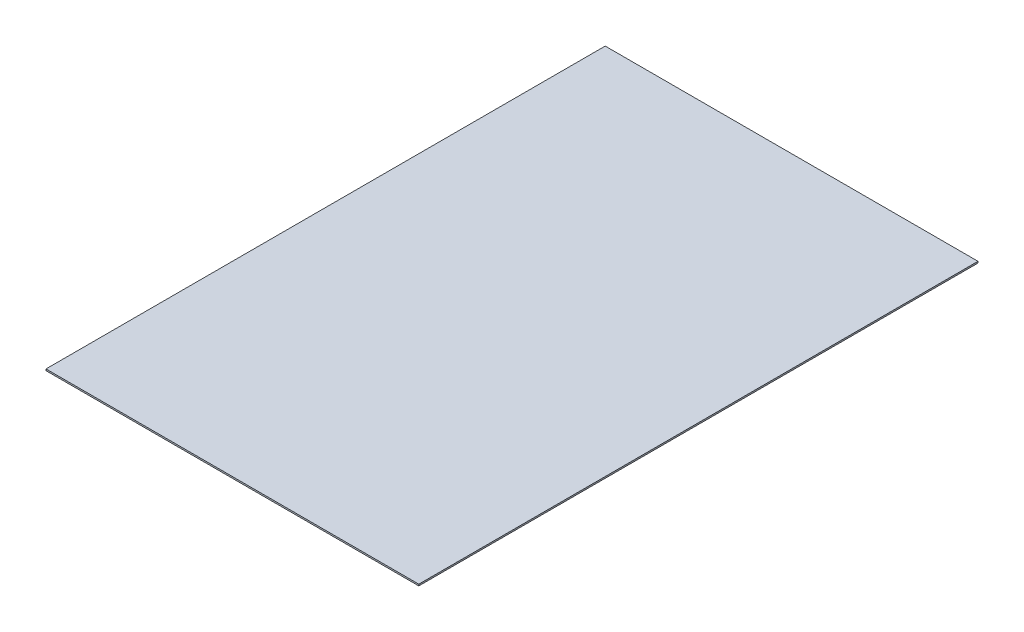
ISO-10303-21;
HEADER;
FILE_DESCRIPTION(('STEP AP214'),'2;1');
FILE_NAME('part.step','',(''),(''),'','','');
FILE_SCHEMA(('AUTOMOTIVE_DESIGN { 1 0 10303 214 1 1 1 1 }'));
ENDSEC;
DATA;
#1=APPLICATION_CONTEXT('core data for automotive mechanical design processes');
#2=APPLICATION_PROTOCOL_DEFINITION('international standard','automotive_design',2000,#1);
#3=PRODUCT_CONTEXT('',#1,'mechanical');
#4=PRODUCT('Part','Part','',(#3));
#5=PRODUCT_RELATED_PRODUCT_CATEGORY('part','',(#4));
#6=PRODUCT_DEFINITION_FORMATION('','',#4);
#7=PRODUCT_DEFINITION_CONTEXT('part definition',#1,'design');
#8=PRODUCT_DEFINITION('design','',#6,#7);
#9=PRODUCT_DEFINITION_SHAPE('','',#8);
#10=(LENGTH_UNIT() NAMED_UNIT(*) SI_UNIT(.MILLI.,.METRE.));
#11=(NAMED_UNIT(*) PLANE_ANGLE_UNIT() SI_UNIT($,.RADIAN.));
#12=(NAMED_UNIT(*) SI_UNIT($,.STERADIAN.) SOLID_ANGLE_UNIT());
#13=UNCERTAINTY_MEASURE_WITH_UNIT(LENGTH_MEASURE(1.E-05),#10,'distance_accuracy_value','');
#14=(GEOMETRIC_REPRESENTATION_CONTEXT(3) GLOBAL_UNCERTAINTY_ASSIGNED_CONTEXT((#13)) GLOBAL_UNIT_ASSIGNED_CONTEXT((#10,
#11,#12)) REPRESENTATION_CONTEXT('',''));
#15=CARTESIAN_POINT('',(0.,0.,0.));
#16=DIRECTION('',(0.,0.,1.));
#17=DIRECTION('',(1.,0.,0.));
#18=AXIS2_PLACEMENT_3D('',#15,#16,#17);
#19=CARTESIAN_POINT('',(-381.000000000001,3.175,571.499999999998));
#20=DIRECTION('',(0.,0.,-1.));
#21=DIRECTION('',(-1.,0.,0.));
#22=AXIS2_PLACEMENT_3D('',#19,#20,#21);
#23=PLANE('',#22);
#24=DIRECTION('',(1.,0.,0.));
#25=VECTOR('',#24,1.);
#26=CARTESIAN_POINT('',(-381.000000000001,0.,571.499999999998));
#27=LINE('',#26,#25);
#28=CARTESIAN_POINT('',(-381.000000000001,0.,571.499999999998));
#29=VERTEX_POINT('',#28);
#30=CARTESIAN_POINT('',(380.999999999999,0.,571.499999999998));
#31=VERTEX_POINT('',#30);
#32=EDGE_CURVE('E96',#29,#31,#27,.T.);
#33=ORIENTED_EDGE('',*,*,#32,.T.);
#34=DIRECTION('',(0.,-1.,0.));
#35=VECTOR('',#34,1.);
#36=CARTESIAN_POINT('',(380.999999999999,3.175,571.499999999998));
#37=LINE('',#36,#35);
#38=CARTESIAN_POINT('',(380.999999999999,3.175,571.499999999998));
#39=VERTEX_POINT('',#38);
#40=EDGE_CURVE('E11',#39,#31,#37,.T.);
#41=ORIENTED_EDGE('',*,*,#40,.F.);
#42=DIRECTION('',(1.,0.,0.));
#43=VECTOR('',#42,1.);
#44=CARTESIAN_POINT('',(-381.000000000001,3.175,571.499999999998));
#45=LINE('',#44,#43);
#46=CARTESIAN_POINT('',(-381.000000000001,3.175,571.499999999998));
#47=VERTEX_POINT('',#46);
#48=EDGE_CURVE('E82',#47,#39,#45,.T.);
#49=ORIENTED_EDGE('',*,*,#48,.F.);
#50=DIRECTION('',(0.,-1.,0.));
#51=VECTOR('',#50,1.);
#52=CARTESIAN_POINT('',(-381.000000000001,3.175,571.499999999998));
#53=LINE('',#52,#51);
#54=EDGE_CURVE('E49',#47,#29,#53,.T.);
#55=ORIENTED_EDGE('',*,*,#54,.T.);
#56=EDGE_LOOP('',(#33,#41,#49,#55));
#57=FACE_BOUND('',#56,.T.);
#58=ADVANCED_FACE('F33',(#57),#23,.F.);
#59=CARTESIAN_POINT('',(380.999999999999,3.175,571.499999999998));
#60=DIRECTION('',(-1.,0.,0.));
#61=DIRECTION('',(0.,0.,1.));
#62=AXIS2_PLACEMENT_3D('',#59,#60,#61);
#63=PLANE('',#62);
#64=DIRECTION('',(0.,0.,-1.));
#65=VECTOR('',#64,1.);
#66=CARTESIAN_POINT('',(380.999999999999,0.,571.499999999998));
#67=LINE('',#66,#65);
#68=CARTESIAN_POINT('',(380.999999999999,0.,-571.500000000001));
#69=VERTEX_POINT('',#68);
#70=EDGE_CURVE('E87',#31,#69,#67,.T.);
#71=ORIENTED_EDGE('',*,*,#70,.T.);
#72=DIRECTION('',(0.,-1.,0.));
#73=VECTOR('',#72,1.);
#74=CARTESIAN_POINT('',(380.999999999999,3.175,-571.500000000001));
#75=LINE('',#74,#73);
#76=CARTESIAN_POINT('',(380.999999999999,3.175,-571.500000000001));
#77=VERTEX_POINT('',#76);
#78=EDGE_CURVE('E41',#77,#69,#75,.T.);
#79=ORIENTED_EDGE('',*,*,#78,.F.);
#80=DIRECTION('',(0.,0.,-1.));
#81=VECTOR('',#80,1.);
#82=CARTESIAN_POINT('',(380.999999999999,3.175,571.499999999998));
#83=LINE('',#82,#81);
#84=EDGE_CURVE('E74',#39,#77,#83,.T.);
#85=ORIENTED_EDGE('',*,*,#84,.F.);
#86=ORIENTED_EDGE('',*,*,#40,.T.);
#87=EDGE_LOOP('',(#71,#79,#85,#86));
#88=FACE_BOUND('',#87,.T.);
#89=ADVANCED_FACE('F86',(#88),#63,.F.);
#90=CARTESIAN_POINT('',(-381.000000000001,3.175,-571.500000000001));
#91=DIRECTION('',(0.,0.,-1.));
#92=DIRECTION('',(-1.,0.,0.));
#93=AXIS2_PLACEMENT_3D('',#90,#91,#92);
#94=PLANE('',#93);
#95=DIRECTION('',(1.,0.,0.));
#96=VECTOR('',#95,1.);
#97=CARTESIAN_POINT('',(-381.000000000001,0.,-571.500000000001));
#98=LINE('',#97,#96);
#99=CARTESIAN_POINT('',(-381.000000000001,0.,-571.500000000001));
#100=VERTEX_POINT('',#99);
#101=EDGE_CURVE('E99',#100,#69,#98,.T.);
#102=ORIENTED_EDGE('',*,*,#101,.F.);
#103=DIRECTION('',(0.,-1.,0.));
#104=VECTOR('',#103,1.);
#105=CARTESIAN_POINT('',(-381.000000000001,3.175,-571.500000000001));
#106=LINE('',#105,#104);
#107=CARTESIAN_POINT('',(-381.000000000001,3.175,-571.500000000001));
#108=VERTEX_POINT('',#107);
#109=EDGE_CURVE('E63',#108,#100,#106,.T.);
#110=ORIENTED_EDGE('',*,*,#109,.F.);
#111=DIRECTION('',(1.,0.,0.));
#112=VECTOR('',#111,1.);
#113=CARTESIAN_POINT('',(-381.000000000001,3.175,-571.500000000001));
#114=LINE('',#113,#112);
#115=EDGE_CURVE('E81',#108,#77,#114,.T.);
#116=ORIENTED_EDGE('',*,*,#115,.T.);
#117=ORIENTED_EDGE('',*,*,#78,.T.);
#118=EDGE_LOOP('',(#102,#110,#116,#117));
#119=FACE_BOUND('',#118,.T.);
#120=ADVANCED_FACE('F90',(#119),#94,.T.);
#121=CARTESIAN_POINT('',(-381.000000000001,3.175,571.499999999998));
#122=DIRECTION('',(-1.,0.,0.));
#123=DIRECTION('',(0.,0.,1.));
#124=AXIS2_PLACEMENT_3D('',#121,#122,#123);
#125=PLANE('',#124);
#126=DIRECTION('',(0.,0.,-1.));
#127=VECTOR('',#126,1.);
#128=CARTESIAN_POINT('',(-381.000000000001,0.,571.499999999998));
#129=LINE('',#128,#127);
#130=EDGE_CURVE('E101',#29,#100,#129,.T.);
#131=ORIENTED_EDGE('',*,*,#130,.F.);
#132=ORIENTED_EDGE('',*,*,#54,.F.);
#133=DIRECTION('',(0.,0.,-1.));
#134=VECTOR('',#133,1.);
#135=CARTESIAN_POINT('',(-381.000000000001,3.175,571.499999999998));
#136=LINE('',#135,#134);
#137=EDGE_CURVE('E91',#47,#108,#136,.T.);
#138=ORIENTED_EDGE('',*,*,#137,.T.);
#139=ORIENTED_EDGE('',*,*,#109,.T.);
#140=EDGE_LOOP('',(#131,#132,#138,#139));
#141=FACE_BOUND('',#140,.T.);
#142=ADVANCED_FACE('F107',(#141),#125,.T.);
#143=CARTESIAN_POINT('',(0.,3.175,0.));
#144=DIRECTION('',(0.,1.,0.));
#145=DIRECTION('',(0.,0.,1.));
#146=AXIS2_PLACEMENT_3D('',#143,#144,#145);
#147=PLANE('',#146);
#148=ORIENTED_EDGE('',*,*,#48,.T.);
#149=ORIENTED_EDGE('',*,*,#84,.T.);
#150=ORIENTED_EDGE('',*,*,#115,.F.);
#151=ORIENTED_EDGE('',*,*,#137,.F.);
#152=EDGE_LOOP('',(#148,#149,#150,#151));
#153=FACE_BOUND('',#152,.T.);
#154=ADVANCED_FACE('F78',(#153),#147,.T.);
#155=CARTESIAN_POINT('',(0.,0.,0.));
#156=DIRECTION('',(0.,1.,0.));
#157=DIRECTION('',(0.,0.,1.));
#158=AXIS2_PLACEMENT_3D('',#155,#156,#157);
#159=PLANE('',#158);
#160=ORIENTED_EDGE('',*,*,#32,.F.);
#161=ORIENTED_EDGE('',*,*,#130,.T.);
#162=ORIENTED_EDGE('',*,*,#101,.T.);
#163=ORIENTED_EDGE('',*,*,#70,.F.);
#164=EDGE_LOOP('',(#160,#161,#162,#163));
#165=FACE_BOUND('',#164,.T.);
#166=ADVANCED_FACE('F106',(#165),#159,.F.);
#167=CLOSED_SHELL('',(#58,#89,#120,#142,#154,#166));
#168=MANIFOLD_SOLID_BREP('B2',#167);
#169=ADVANCED_BREP_SHAPE_REPRESENTATION('',(#18,#168),#14);
#170=SHAPE_DEFINITION_REPRESENTATION(#9,#169);
ENDSEC;
END-ISO-10303-21;
